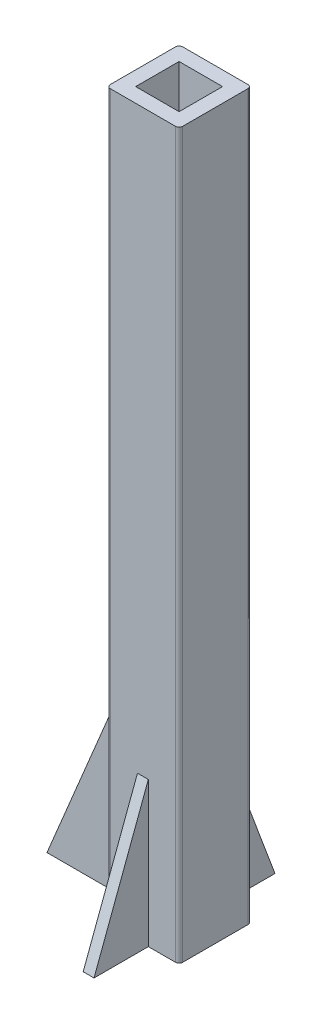
ISO-10303-21;
HEADER;
FILE_DESCRIPTION(('STEP AP214'),'2;1');
FILE_NAME('part.step','',(''),(''),'','','');
FILE_SCHEMA(('AUTOMOTIVE_DESIGN { 1 0 10303 214 1 1 1 1 }'));
ENDSEC;
DATA;
#1=APPLICATION_CONTEXT('core data for automotive mechanical design processes');
#2=APPLICATION_PROTOCOL_DEFINITION('international standard','automotive_design',2000,#1);
#3=PRODUCT_CONTEXT('',#1,'mechanical');
#4=PRODUCT('Part','Part','',(#3));
#5=PRODUCT_RELATED_PRODUCT_CATEGORY('part','',(#4));
#6=PRODUCT_DEFINITION_FORMATION('','',#4);
#7=PRODUCT_DEFINITION_CONTEXT('part definition',#1,'design');
#8=PRODUCT_DEFINITION('design','',#6,#7);
#9=PRODUCT_DEFINITION_SHAPE('','',#8);
#10=(LENGTH_UNIT() NAMED_UNIT(*) SI_UNIT(.MILLI.,.METRE.));
#11=(NAMED_UNIT(*) PLANE_ANGLE_UNIT() SI_UNIT($,.RADIAN.));
#12=(NAMED_UNIT(*) SI_UNIT($,.STERADIAN.) SOLID_ANGLE_UNIT());
#13=UNCERTAINTY_MEASURE_WITH_UNIT(LENGTH_MEASURE(1.E-05),#10,'distance_accuracy_value','');
#14=(GEOMETRIC_REPRESENTATION_CONTEXT(3) GLOBAL_UNCERTAINTY_ASSIGNED_CONTEXT((#13)) GLOBAL_UNIT_ASSIGNED_CONTEXT((#10,
#11,#12)) REPRESENTATION_CONTEXT('',''));
#15=CARTESIAN_POINT('',(0.,0.,0.));
#16=DIRECTION('',(0.,0.,1.));
#17=DIRECTION('',(1.,0.,0.));
#18=AXIS2_PLACEMENT_3D('',#15,#16,#17);
#19=CARTESIAN_POINT('',(-120.263863997574,1779.30525325612,115.));
#20=DIRECTION('',(1.,0.,0.));
#21=DIRECTION('',(0.,0.,-1.));
#22=AXIS2_PLACEMENT_3D('',#19,#20,#21);
#23=PLANE('',#22);
#24=DIRECTION('',(0.,-1.,0.));
#25=VECTOR('',#24,1.);
#26=CARTESIAN_POINT('',(-120.263863997574,-320.694746743877,-42.5));
#27=LINE('',#26,#25);
#28=CARTESIAN_POINT('',(-120.263863997574,-320.694746743877,-42.5));
#29=VERTEX_POINT('',#28);
#30=CARTESIAN_POINT('',(-120.263863997574,-1220.69474674388,-42.5));
#31=VERTEX_POINT('',#30);
#32=EDGE_CURVE('E192',#29,#31,#27,.T.);
#33=ORIENTED_EDGE('',*,*,#32,.F.);
#34=DIRECTION('',(0.,0.,1.));
#35=VECTOR('',#34,1.);
#36=CARTESIAN_POINT('',(-120.263863997574,-320.694746743877,-42.5));
#37=LINE('',#36,#35);
#38=CARTESIAN_POINT('',(-120.263863997574,-320.694746743877,2.49999999999998));
#39=VERTEX_POINT('',#38);
#40=EDGE_CURVE('E189',#29,#39,#37,.T.);
#41=ORIENTED_EDGE('',*,*,#40,.T.);
#42=DIRECTION('',(0.,-1.,0.));
#43=VECTOR('',#42,1.);
#44=CARTESIAN_POINT('',(-120.263863997574,-320.694746743877,2.49999999999998));
#45=LINE('',#44,#43);
#46=CARTESIAN_POINT('',(-120.263863997574,-1220.69474674388,2.49999999999998));
#47=VERTEX_POINT('',#46);
#48=EDGE_CURVE('E200',#39,#47,#45,.T.);
#49=ORIENTED_EDGE('',*,*,#48,.T.);
#50=DIRECTION('',(0.,0.,1.));
#51=VECTOR('',#50,1.);
#52=CARTESIAN_POINT('',(-120.263863997574,-1220.69474674388,115.));
#53=LINE('',#52,#51);
#54=CARTESIAN_POINT('',(-120.263863997574,-1220.69474674388,115.));
#55=VERTEX_POINT('',#54);
#56=EDGE_CURVE('E314',#47,#55,#53,.T.);
#57=ORIENTED_EDGE('',*,*,#56,.T.);
#58=DIRECTION('',(0.,-1.,0.));
#59=VECTOR('',#58,1.);
#60=CARTESIAN_POINT('',(-120.263863997574,1779.30525325612,115.));
#61=LINE('',#60,#59);
#62=CARTESIAN_POINT('',(-120.263863997574,1779.30525325612,115.));
#63=VERTEX_POINT('',#62);
#64=EDGE_CURVE('E297',#63,#55,#61,.T.);
#65=ORIENTED_EDGE('',*,*,#64,.F.);
#66=DIRECTION('',(0.,0.,1.));
#67=VECTOR('',#66,1.);
#68=CARTESIAN_POINT('',(-120.263863997574,1779.30525325612,115.));
#69=LINE('',#68,#67);
#70=CARTESIAN_POINT('',(-120.263863997574,1779.30525325612,-155.));
#71=VERTEX_POINT('',#70);
#72=EDGE_CURVE('E295',#71,#63,#69,.T.);
#73=ORIENTED_EDGE('',*,*,#72,.F.);
#74=DIRECTION('',(0.,-1.,0.));
#75=VECTOR('',#74,1.);
#76=CARTESIAN_POINT('',(-120.263863997574,1779.30525325612,-155.));
#77=LINE('',#76,#75);
#78=CARTESIAN_POINT('',(-120.263863997574,-1220.69474674388,-155.));
#79=VERTEX_POINT('',#78);
#80=EDGE_CURVE('E318',#71,#79,#77,.T.);
#81=ORIENTED_EDGE('',*,*,#80,.T.);
#82=EDGE_CURVE('E283',#79,#31,#53,.T.);
#83=ORIENTED_EDGE('',*,*,#82,.T.);
#84=EDGE_LOOP('',(#33,#41,#49,#57,#65,#73,#81,#83));
#85=FACE_BOUND('',#84,.T.);
#86=ADVANCED_FACE('F39',(#85),#23,.F.);
#87=CARTESIAN_POINT('',(-105.263863997574,1779.30525325612,115.));
#88=DIRECTION('',(0.,-1.,0.));
#89=DIRECTION('',(0.,0.,-1.));
#90=AXIS2_PLACEMENT_3D('',#87,#88,#89);
#91=PLANE('',#90);
#92=CARTESIAN_POINT('',(-105.263863997574,1779.30525325612,115.));
#93=DIRECTION('',(0.,1.,0.));
#94=DIRECTION('',(0.,0.,-1.));
#95=AXIS2_PLACEMENT_3D('',#92,#93,#94);
#96=CIRCLE('',#95,15.);
#97=CARTESIAN_POINT('',(-105.263863997574,1779.30525325612,130.));
#98=VERTEX_POINT('',#97);
#99=EDGE_CURVE('E279',#63,#98,#96,.T.);
#100=ORIENTED_EDGE('',*,*,#99,.T.);
#101=DIRECTION('',(1.,0.,0.));
#102=VECTOR('',#101,1.);
#103=CARTESIAN_POINT('',(-105.263863997574,1779.30525325612,130.));
#104=LINE('',#103,#102);
#105=CARTESIAN_POINT('',(164.736136002426,1779.30525325612,130.));
#106=VERTEX_POINT('',#105);
#107=EDGE_CURVE('E282',#98,#106,#104,.T.);
#108=ORIENTED_EDGE('',*,*,#107,.T.);
#109=CARTESIAN_POINT('',(164.736136002426,1779.30525325612,115.));
#110=DIRECTION('',(0.,1.,0.));
#111=DIRECTION('',(0.,0.,1.));
#112=AXIS2_PLACEMENT_3D('',#109,#110,#111);
#113=CIRCLE('',#112,15.);
#114=CARTESIAN_POINT('',(179.736136002426,1779.30525325612,115.));
#115=VERTEX_POINT('',#114);
#116=EDGE_CURVE('E285',#106,#115,#113,.T.);
#117=ORIENTED_EDGE('',*,*,#116,.T.);
#118=DIRECTION('',(0.,0.,-1.));
#119=VECTOR('',#118,1.);
#120=CARTESIAN_POINT('',(179.736136002426,1779.30525325612,115.));
#121=LINE('',#120,#119);
#122=CARTESIAN_POINT('',(179.736136002426,1779.30525325612,-155.));
#123=VERTEX_POINT('',#122);
#124=EDGE_CURVE('E287',#115,#123,#121,.T.);
#125=ORIENTED_EDGE('',*,*,#124,.T.);
#126=CARTESIAN_POINT('',(164.736136002426,1779.30525325612,-155.));
#127=DIRECTION('',(0.,1.,0.));
#128=DIRECTION('',(0.,0.,-1.));
#129=AXIS2_PLACEMENT_3D('',#126,#127,#128);
#130=CIRCLE('',#129,15.);
#131=CARTESIAN_POINT('',(164.736136002426,1779.30525325612,-170.));
#132=VERTEX_POINT('',#131);
#133=EDGE_CURVE('E289',#123,#132,#130,.T.);
#134=ORIENTED_EDGE('',*,*,#133,.T.);
#135=DIRECTION('',(-1.,0.,0.));
#136=VECTOR('',#135,1.);
#137=CARTESIAN_POINT('',(-105.263863997574,1779.30525325612,-170.));
#138=LINE('',#137,#136);
#139=CARTESIAN_POINT('',(-105.263863997574,1779.30525325612,-170.));
#140=VERTEX_POINT('',#139);
#141=EDGE_CURVE('E291',#132,#140,#138,.T.);
#142=ORIENTED_EDGE('',*,*,#141,.T.);
#143=CARTESIAN_POINT('',(-105.263863997574,1779.30525325612,-155.));
#144=DIRECTION('',(0.,1.,0.));
#145=DIRECTION('',(0.,0.,-1.));
#146=AXIS2_PLACEMENT_3D('',#143,#144,#145);
#147=CIRCLE('',#146,15.);
#148=EDGE_CURVE('E293',#140,#71,#147,.T.);
#149=ORIENTED_EDGE('',*,*,#148,.T.);
#150=ORIENTED_EDGE('',*,*,#72,.T.);
#151=EDGE_LOOP('',(#100,#108,#117,#125,#134,#142,#149,#150));
#152=FACE_BOUND('',#151,.T.);
#153=DIRECTION('',(0.,0.,1.));
#154=VECTOR('',#153,1.);
#155=CARTESIAN_POINT('',(-60.2638639975741,1779.30525325612,70.));
#156=LINE('',#155,#154);
#157=CARTESIAN_POINT('',(-60.2638639975741,1779.30525325612,-110.));
#158=VERTEX_POINT('',#157);
#159=CARTESIAN_POINT('',(-60.2638639975741,1779.30525325612,70.));
#160=VERTEX_POINT('',#159);
#161=EDGE_CURVE('E249',#158,#160,#156,.T.);
#162=ORIENTED_EDGE('',*,*,#161,.F.);
#163=DIRECTION('',(-1.,0.,0.));
#164=VECTOR('',#163,1.);
#165=CARTESIAN_POINT('',(-60.2638639975741,1779.30525325612,-110.));
#166=LINE('',#165,#164);
#167=CARTESIAN_POINT('',(119.736136002426,1779.30525325612,-110.));
#168=VERTEX_POINT('',#167);
#169=EDGE_CURVE('E257',#168,#158,#166,.T.);
#170=ORIENTED_EDGE('',*,*,#169,.F.);
#171=DIRECTION('',(0.,0.,-1.));
#172=VECTOR('',#171,1.);
#173=CARTESIAN_POINT('',(119.736136002426,1779.30525325612,70.));
#174=LINE('',#173,#172);
#175=CARTESIAN_POINT('',(119.736136002426,1779.30525325612,70.));
#176=VERTEX_POINT('',#175);
#177=EDGE_CURVE('E254',#176,#168,#174,.T.);
#178=ORIENTED_EDGE('',*,*,#177,.F.);
#179=DIRECTION('',(1.,0.,0.));
#180=VECTOR('',#179,1.);
#181=CARTESIAN_POINT('',(-60.2638639975741,1779.30525325612,70.));
#182=LINE('',#181,#180);
#183=EDGE_CURVE('E251',#160,#176,#182,.T.);
#184=ORIENTED_EDGE('',*,*,#183,.F.);
#185=EDGE_LOOP('',(#162,#170,#178,#184));
#186=FACE_BOUND('',#185,.T.);
#187=ADVANCED_FACE('F355',(#152,#186),#91,.F.);
#188=CARTESIAN_POINT('',(-105.263863997574,-1220.69474674388,115.));
#189=DIRECTION('',(0.,-1.,0.));
#190=DIRECTION('',(0.,0.,-1.));
#191=AXIS2_PLACEMENT_3D('',#188,#189,#190);
#192=PLANE('',#191);
#193=DIRECTION('',(1.,0.,0.));
#194=VECTOR('',#193,1.);
#195=CARTESIAN_POINT('',(-60.2638639975741,-1220.69474674388,70.));
#196=LINE('',#195,#194);
#197=CARTESIAN_POINT('',(-60.2638639975741,-1220.69474674388,70.));
#198=VERTEX_POINT('',#197);
#199=CARTESIAN_POINT('',(119.736136002426,-1220.69474674388,70.));
#200=VERTEX_POINT('',#199);
#201=EDGE_CURVE('E262',#198,#200,#196,.T.);
#202=ORIENTED_EDGE('',*,*,#201,.T.);
#203=DIRECTION('',(0.,0.,-1.));
#204=VECTOR('',#203,1.);
#205=CARTESIAN_POINT('',(119.736136002426,-1220.69474674388,70.));
#206=LINE('',#205,#204);
#207=CARTESIAN_POINT('',(119.736136002426,-1220.69474674388,-110.));
#208=VERTEX_POINT('',#207);
#209=EDGE_CURVE('E264',#200,#208,#206,.T.);
#210=ORIENTED_EDGE('',*,*,#209,.T.);
#211=DIRECTION('',(-1.,0.,0.));
#212=VECTOR('',#211,1.);
#213=CARTESIAN_POINT('',(-60.2638639975741,-1220.69474674388,-110.));
#214=LINE('',#213,#212);
#215=CARTESIAN_POINT('',(-60.2638639975741,-1220.69474674388,-110.));
#216=VERTEX_POINT('',#215);
#217=EDGE_CURVE('E252',#208,#216,#214,.T.);
#218=ORIENTED_EDGE('',*,*,#217,.T.);
#219=DIRECTION('',(0.,0.,1.));
#220=VECTOR('',#219,1.);
#221=CARTESIAN_POINT('',(-60.2638639975741,-1220.69474674388,70.));
#222=LINE('',#221,#220);
#223=EDGE_CURVE('E248',#216,#198,#222,.T.);
#224=ORIENTED_EDGE('',*,*,#223,.T.);
#225=EDGE_LOOP('',(#202,#210,#218,#224));
#226=FACE_BOUND('',#225,.T.);
#227=DIRECTION('',(0.,0.,1.));
#228=VECTOR('',#227,1.);
#229=CARTESIAN_POINT('',(7.23613600242592,-1220.69474674388,-16.3831962191717));
#230=LINE('',#229,#228);
#231=CARTESIAN_POINT('',(7.23613600242592,-1220.69474674388,130.));
#232=VERTEX_POINT('',#231);
#233=CARTESIAN_POINT('',(7.23613600242592,-1220.69474674388,355.));
#234=VERTEX_POINT('',#233);
#235=EDGE_CURVE('E229',#232,#234,#230,.T.);
#236=ORIENTED_EDGE('',*,*,#235,.F.);
#237=DIRECTION('',(1.,0.,0.));
#238=VECTOR('',#237,1.);
#239=CARTESIAN_POINT('',(-105.263863997574,-1220.69474674388,130.));
#240=LINE('',#239,#238);
#241=CARTESIAN_POINT('',(-105.263863997574,-1220.69474674388,130.));
#242=VERTEX_POINT('',#241);
#243=EDGE_CURVE('E301',#242,#232,#240,.T.);
#244=ORIENTED_EDGE('',*,*,#243,.F.);
#245=CARTESIAN_POINT('',(-105.263863997574,-1220.69474674388,115.));
#246=DIRECTION('',(0.,1.,0.));
#247=DIRECTION('',(0.,0.,-1.));
#248=AXIS2_PLACEMENT_3D('',#245,#246,#247);
#249=CIRCLE('',#248,15.);
#250=EDGE_CURVE('E278',#55,#242,#249,.T.);
#251=ORIENTED_EDGE('',*,*,#250,.F.);
#252=ORIENTED_EDGE('',*,*,#56,.F.);
#253=DIRECTION('',(-1.,0.,0.));
#254=VECTOR('',#253,1.);
#255=CARTESIAN_POINT('',(-120.263863997574,-1220.69474674388,2.49999999999998));
#256=LINE('',#255,#254);
#257=CARTESIAN_POINT('',(-495.263863997574,-1220.69474674388,2.49999999999998));
#258=VERTEX_POINT('',#257);
#259=EDGE_CURVE('E54',#47,#258,#256,.T.);
#260=ORIENTED_EDGE('',*,*,#259,.T.);
#261=DIRECTION('',(0.,0.,1.));
#262=VECTOR('',#261,1.);
#263=CARTESIAN_POINT('',(-495.263863997574,-1220.69474674388,-42.5));
#264=LINE('',#263,#262);
#265=CARTESIAN_POINT('',(-495.263863997574,-1220.69474674388,-42.5));
#266=VERTEX_POINT('',#265);
#267=EDGE_CURVE('E187',#266,#258,#264,.T.);
#268=ORIENTED_EDGE('',*,*,#267,.F.);
#269=DIRECTION('',(-1.,0.,0.));
#270=VECTOR('',#269,1.);
#271=CARTESIAN_POINT('',(-120.263863997574,-1220.69474674388,-42.5));
#272=LINE('',#271,#270);
#273=EDGE_CURVE('E193',#31,#266,#272,.T.);
#274=ORIENTED_EDGE('',*,*,#273,.F.);
#275=ORIENTED_EDGE('',*,*,#82,.F.);
#276=CARTESIAN_POINT('',(-105.263863997574,-1220.69474674388,-155.));
#277=DIRECTION('',(0.,1.,0.));
#278=DIRECTION('',(0.,0.,-1.));
#279=AXIS2_PLACEMENT_3D('',#276,#277,#278);
#280=CIRCLE('',#279,15.);
#281=CARTESIAN_POINT('',(-105.263863997574,-1220.69474674388,-170.));
#282=VERTEX_POINT('',#281);
#283=EDGE_CURVE('E312',#282,#79,#280,.T.);
#284=ORIENTED_EDGE('',*,*,#283,.F.);
#285=DIRECTION('',(-1.,0.,0.));
#286=VECTOR('',#285,1.);
#287=CARTESIAN_POINT('',(-105.263863997574,-1220.69474674388,-170.));
#288=LINE('',#287,#286);
#289=CARTESIAN_POINT('',(7.23613600242592,-1220.69474674388,-170.));
#290=VERTEX_POINT('',#289);
#291=EDGE_CURVE('E309',#290,#282,#288,.T.);
#292=ORIENTED_EDGE('',*,*,#291,.F.);
#293=DIRECTION('',(0.,0.,1.));
#294=VECTOR('',#293,1.);
#295=CARTESIAN_POINT('',(7.23613600242592,-1220.69474674388,85.4213670513897));
#296=LINE('',#295,#294);
#297=CARTESIAN_POINT('',(7.23613600242592,-1220.69474674388,-395.));
#298=VERTEX_POINT('',#297);
#299=EDGE_CURVE('E216',#290,#298,#296,.F.);
#300=ORIENTED_EDGE('',*,*,#299,.T.);
#301=DIRECTION('',(-1.,0.,0.));
#302=VECTOR('',#301,1.);
#303=CARTESIAN_POINT('',(29.7361360024259,-1220.69474674388,-395.));
#304=LINE('',#303,#302);
#305=CARTESIAN_POINT('',(52.2361360024259,-1220.69474674388,-395.));
#306=VERTEX_POINT('',#305);
#307=EDGE_CURVE('E215',#306,#298,#304,.T.);
#308=ORIENTED_EDGE('',*,*,#307,.F.);
#309=DIRECTION('',(0.,0.,1.));
#310=VECTOR('',#309,1.);
#311=CARTESIAN_POINT('',(52.2361360024259,-1220.69474674388,85.4213670513897));
#312=LINE('',#311,#310);
#313=CARTESIAN_POINT('',(52.2361360024259,-1220.69474674388,-170.));
#314=VERTEX_POINT('',#313);
#315=EDGE_CURVE('E205',#314,#306,#312,.F.);
#316=ORIENTED_EDGE('',*,*,#315,.F.);
#317=CARTESIAN_POINT('',(164.736136002426,-1220.69474674388,-170.));
#318=VERTEX_POINT('',#317);
#319=EDGE_CURVE('E310',#318,#314,#288,.T.);
#320=ORIENTED_EDGE('',*,*,#319,.F.);
#321=CARTESIAN_POINT('',(164.736136002426,-1220.69474674388,-155.));
#322=DIRECTION('',(0.,1.,0.));
#323=DIRECTION('',(0.,0.,-1.));
#324=AXIS2_PLACEMENT_3D('',#321,#322,#323);
#325=CIRCLE('',#324,15.);
#326=CARTESIAN_POINT('',(179.736136002426,-1220.69474674388,-155.));
#327=VERTEX_POINT('',#326);
#328=EDGE_CURVE('E307',#327,#318,#325,.T.);
#329=ORIENTED_EDGE('',*,*,#328,.F.);
#330=DIRECTION('',(0.,0.,-1.));
#331=VECTOR('',#330,1.);
#332=CARTESIAN_POINT('',(179.736136002426,-1220.69474674388,115.));
#333=LINE('',#332,#331);
#334=CARTESIAN_POINT('',(179.736136002426,-1220.69474674388,115.));
#335=VERTEX_POINT('',#334);
#336=EDGE_CURVE('E305',#335,#327,#333,.T.);
#337=ORIENTED_EDGE('',*,*,#336,.F.);
#338=CARTESIAN_POINT('',(164.736136002426,-1220.69474674388,115.));
#339=DIRECTION('',(0.,1.,0.));
#340=DIRECTION('',(0.,0.,1.));
#341=AXIS2_PLACEMENT_3D('',#338,#339,#340);
#342=CIRCLE('',#341,15.);
#343=CARTESIAN_POINT('',(164.736136002426,-1220.69474674388,130.));
#344=VERTEX_POINT('',#343);
#345=EDGE_CURVE('E303',#344,#335,#342,.T.);
#346=ORIENTED_EDGE('',*,*,#345,.F.);
#347=CARTESIAN_POINT('',(52.2361360024259,-1220.69474674388,130.));
#348=VERTEX_POINT('',#347);
#349=EDGE_CURVE('E300',#348,#344,#240,.T.);
#350=ORIENTED_EDGE('',*,*,#349,.F.);
#351=DIRECTION('',(0.,0.,1.));
#352=VECTOR('',#351,1.);
#353=CARTESIAN_POINT('',(52.2361360024259,-1220.69474674388,-16.3831962191717));
#354=LINE('',#353,#352);
#355=CARTESIAN_POINT('',(52.2361360024259,-1220.69474674388,355.));
#356=VERTEX_POINT('',#355);
#357=EDGE_CURVE('E228',#348,#356,#354,.T.);
#358=ORIENTED_EDGE('',*,*,#357,.T.);
#359=DIRECTION('',(-1.,0.,0.));
#360=VECTOR('',#359,1.);
#361=CARTESIAN_POINT('',(29.7361360024259,-1220.69474674388,355.));
#362=LINE('',#361,#360);
#363=EDGE_CURVE('E235',#356,#234,#362,.T.);
#364=ORIENTED_EDGE('',*,*,#363,.T.);
#365=EDGE_LOOP('',(#236,#244,#251,#252,#260,#268,#274,#275,#284,#292,#300,#308,#316,#320,#329,
#337,#346,#350,#358,#364));
#366=FACE_BOUND('',#365,.T.);
#367=ADVANCED_FACE('F203',(#226,#366),#192,.T.);
#368=CARTESIAN_POINT('',(-105.263863997574,1779.30525325612,115.));
#369=DIRECTION('',(0.,-1.,0.));
#370=DIRECTION('',(0.,0.,-1.));
#371=AXIS2_PLACEMENT_3D('',#368,#369,#370);
#372=CYLINDRICAL_SURFACE('',#371,15.);
#373=ORIENTED_EDGE('',*,*,#250,.T.);
#374=DIRECTION('',(0.,-1.,0.));
#375=VECTOR('',#374,1.);
#376=CARTESIAN_POINT('',(-105.263863997574,1779.30525325612,130.));
#377=LINE('',#376,#375);
#378=EDGE_CURVE('E11',#98,#242,#377,.T.);
#379=ORIENTED_EDGE('',*,*,#378,.F.);
#380=ORIENTED_EDGE('',*,*,#99,.F.);
#381=ORIENTED_EDGE('',*,*,#64,.T.);
#382=EDGE_LOOP('',(#373,#379,#380,#381));
#383=FACE_BOUND('',#382,.T.);
#384=ADVANCED_FACE('F41',(#383),#372,.T.);
#385=CARTESIAN_POINT('',(-105.263863997574,1779.30525325612,130.));
#386=DIRECTION('',(0.,0.,-1.));
#387=DIRECTION('',(-1.,0.,0.));
#388=AXIS2_PLACEMENT_3D('',#385,#386,#387);
#389=PLANE('',#388);
#390=DIRECTION('',(0.,1.,0.));
#391=VECTOR('',#390,1.);
#392=CARTESIAN_POINT('',(7.23613600242592,1779.30525325612,130.));
#393=LINE('',#392,#391);
#394=CARTESIAN_POINT('',(7.2361360024259,-620.694746743877,130.));
#395=VERTEX_POINT('',#394);
#396=EDGE_CURVE('E244',#232,#395,#393,.T.);
#397=ORIENTED_EDGE('',*,*,#396,.T.);
#398=DIRECTION('',(1.,0.,0.));
#399=VECTOR('',#398,1.);
#400=CARTESIAN_POINT('',(-105.263863997574,-620.694746743877,130.));
#401=LINE('',#400,#399);
#402=CARTESIAN_POINT('',(52.2361360024259,-620.694746743877,130.));
#403=VERTEX_POINT('',#402);
#404=EDGE_CURVE('E246',#395,#403,#401,.T.);
#405=ORIENTED_EDGE('',*,*,#404,.T.);
#406=DIRECTION('',(0.,1.,0.));
#407=VECTOR('',#406,1.);
#408=CARTESIAN_POINT('',(52.2361360024259,1779.30525325612,130.));
#409=LINE('',#408,#407);
#410=EDGE_CURVE('E241',#348,#403,#409,.T.);
#411=ORIENTED_EDGE('',*,*,#410,.F.);
#412=ORIENTED_EDGE('',*,*,#349,.T.);
#413=DIRECTION('',(0.,-1.,0.));
#414=VECTOR('',#413,1.);
#415=CARTESIAN_POINT('',(164.736136002426,1779.30525325612,130.));
#416=LINE('',#415,#414);
#417=EDGE_CURVE('E47',#106,#344,#416,.T.);
#418=ORIENTED_EDGE('',*,*,#417,.F.);
#419=ORIENTED_EDGE('',*,*,#107,.F.);
#420=ORIENTED_EDGE('',*,*,#378,.T.);
#421=ORIENTED_EDGE('',*,*,#243,.T.);
#422=EDGE_LOOP('',(#397,#405,#411,#412,#418,#419,#420,#421));
#423=FACE_BOUND('',#422,.T.);
#424=ADVANCED_FACE('F360',(#423),#389,.F.);
#425=CARTESIAN_POINT('',(164.736136002426,1779.30525325612,115.));
#426=DIRECTION('',(0.,-1.,0.));
#427=DIRECTION('',(0.,0.,-1.));
#428=AXIS2_PLACEMENT_3D('',#425,#426,#427);
#429=CYLINDRICAL_SURFACE('',#428,15.);
#430=ORIENTED_EDGE('',*,*,#345,.T.);
#431=DIRECTION('',(0.,-1.,0.));
#432=VECTOR('',#431,1.);
#433=CARTESIAN_POINT('',(179.736136002426,1779.30525325612,115.));
#434=LINE('',#433,#432);
#435=EDGE_CURVE('E330',#115,#335,#434,.T.);
#436=ORIENTED_EDGE('',*,*,#435,.F.);
#437=ORIENTED_EDGE('',*,*,#116,.F.);
#438=ORIENTED_EDGE('',*,*,#417,.T.);
#439=EDGE_LOOP('',(#430,#436,#437,#438));
#440=FACE_BOUND('',#439,.T.);
#441=ADVANCED_FACE('F337',(#440),#429,.T.);
#442=CARTESIAN_POINT('',(179.736136002426,1779.30525325612,115.));
#443=DIRECTION('',(-1.,0.,0.));
#444=DIRECTION('',(0.,0.,1.));
#445=AXIS2_PLACEMENT_3D('',#442,#443,#444);
#446=PLANE('',#445);
#447=ORIENTED_EDGE('',*,*,#336,.T.);
#448=DIRECTION('',(0.,-1.,0.));
#449=VECTOR('',#448,1.);
#450=CARTESIAN_POINT('',(179.736136002426,1779.30525325612,-155.));
#451=LINE('',#450,#449);
#452=EDGE_CURVE('E327',#123,#327,#451,.T.);
#453=ORIENTED_EDGE('',*,*,#452,.F.);
#454=ORIENTED_EDGE('',*,*,#124,.F.);
#455=ORIENTED_EDGE('',*,*,#435,.T.);
#456=EDGE_LOOP('',(#447,#453,#454,#455));
#457=FACE_BOUND('',#456,.T.);
#458=ADVANCED_FACE('F347',(#457),#446,.F.);
#459=CARTESIAN_POINT('',(164.736136002426,1779.30525325612,-155.));
#460=DIRECTION('',(0.,-1.,0.));
#461=DIRECTION('',(0.,0.,-1.));
#462=AXIS2_PLACEMENT_3D('',#459,#460,#461);
#463=CYLINDRICAL_SURFACE('',#462,15.);
#464=ORIENTED_EDGE('',*,*,#328,.T.);
#465=DIRECTION('',(0.,-1.,0.));
#466=VECTOR('',#465,1.);
#467=CARTESIAN_POINT('',(164.736136002426,1779.30525325612,-170.));
#468=LINE('',#467,#466);
#469=EDGE_CURVE('E324',#132,#318,#468,.T.);
#470=ORIENTED_EDGE('',*,*,#469,.F.);
#471=ORIENTED_EDGE('',*,*,#133,.F.);
#472=ORIENTED_EDGE('',*,*,#452,.T.);
#473=EDGE_LOOP('',(#464,#470,#471,#472));
#474=FACE_BOUND('',#473,.T.);
#475=ADVANCED_FACE('F351',(#474),#463,.T.);
#476=CARTESIAN_POINT('',(-105.263863997574,1779.30525325612,-170.));
#477=DIRECTION('',(0.,0.,1.));
#478=DIRECTION('',(1.,0.,0.));
#479=AXIS2_PLACEMENT_3D('',#476,#477,#478);
#480=PLANE('',#479);
#481=DIRECTION('',(1.,0.,0.));
#482=VECTOR('',#481,1.);
#483=CARTESIAN_POINT('',(-105.263863997574,-620.694746743877,-170.));
#484=LINE('',#483,#482);
#485=CARTESIAN_POINT('',(52.2361360024259,-620.694746743877,-170.));
#486=VERTEX_POINT('',#485);
#487=CARTESIAN_POINT('',(7.2361360024259,-620.694746743877,-170.));
#488=VERTEX_POINT('',#487);
#489=EDGE_CURVE('E62',#486,#488,#484,.F.);
#490=ORIENTED_EDGE('',*,*,#489,.T.);
#491=DIRECTION('',(0.,-1.,0.));
#492=VECTOR('',#491,1.);
#493=CARTESIAN_POINT('',(7.23613600242592,1779.30525325612,-170.));
#494=LINE('',#493,#492);
#495=EDGE_CURVE('E225',#488,#290,#494,.T.);
#496=ORIENTED_EDGE('',*,*,#495,.T.);
#497=ORIENTED_EDGE('',*,*,#291,.T.);
#498=DIRECTION('',(0.,-1.,0.));
#499=VECTOR('',#498,1.);
#500=CARTESIAN_POINT('',(-105.263863997574,1779.30525325612,-170.));
#501=LINE('',#500,#499);
#502=EDGE_CURVE('E321',#140,#282,#501,.T.);
#503=ORIENTED_EDGE('',*,*,#502,.F.);
#504=ORIENTED_EDGE('',*,*,#141,.F.);
#505=ORIENTED_EDGE('',*,*,#469,.T.);
#506=ORIENTED_EDGE('',*,*,#319,.T.);
#507=DIRECTION('',(0.,-1.,0.));
#508=VECTOR('',#507,1.);
#509=CARTESIAN_POINT('',(52.2361360024259,1779.30525325612,-170.));
#510=LINE('',#509,#508);
#511=EDGE_CURVE('E222',#486,#314,#510,.T.);
#512=ORIENTED_EDGE('',*,*,#511,.F.);
#513=EDGE_LOOP('',(#490,#496,#497,#503,#504,#505,#506,#512));
#514=FACE_BOUND('',#513,.T.);
#515=ADVANCED_FACE('F400',(#514),#480,.F.);
#516=CARTESIAN_POINT('',(-105.263863997574,1779.30525325612,-155.));
#517=DIRECTION('',(0.,-1.,0.));
#518=DIRECTION('',(0.,0.,-1.));
#519=AXIS2_PLACEMENT_3D('',#516,#517,#518);
#520=CYLINDRICAL_SURFACE('',#519,15.);
#521=ORIENTED_EDGE('',*,*,#283,.T.);
#522=ORIENTED_EDGE('',*,*,#80,.F.);
#523=ORIENTED_EDGE('',*,*,#148,.F.);
#524=ORIENTED_EDGE('',*,*,#502,.T.);
#525=EDGE_LOOP('',(#521,#522,#523,#524));
#526=FACE_BOUND('',#525,.T.);
#527=ADVANCED_FACE('F396',(#526),#520,.T.);
#528=CARTESIAN_POINT('',(-60.2638639975741,1779.30525325612,70.));
#529=DIRECTION('',(1.,0.,0.));
#530=DIRECTION('',(0.,0.,-1.));
#531=AXIS2_PLACEMENT_3D('',#528,#529,#530);
#532=PLANE('',#531);
#533=ORIENTED_EDGE('',*,*,#223,.F.);
#534=DIRECTION('',(0.,-1.,0.));
#535=VECTOR('',#534,1.);
#536=CARTESIAN_POINT('',(-60.2638639975741,1779.30525325612,-110.));
#537=LINE('',#536,#535);
#538=EDGE_CURVE('E259',#158,#216,#537,.T.);
#539=ORIENTED_EDGE('',*,*,#538,.F.);
#540=ORIENTED_EDGE('',*,*,#161,.T.);
#541=DIRECTION('',(0.,-1.,0.));
#542=VECTOR('',#541,1.);
#543=CARTESIAN_POINT('',(-60.2638639975741,1779.30525325612,70.));
#544=LINE('',#543,#542);
#545=EDGE_CURVE('E275',#160,#198,#544,.T.);
#546=ORIENTED_EDGE('',*,*,#545,.T.);
#547=EDGE_LOOP('',(#533,#539,#540,#546));
#548=FACE_BOUND('',#547,.T.);
#549=ADVANCED_FACE('F399',(#548),#532,.T.);
#550=CARTESIAN_POINT('',(-60.2638639975741,1779.30525325612,70.));
#551=DIRECTION('',(0.,0.,-1.));
#552=DIRECTION('',(-1.,0.,0.));
#553=AXIS2_PLACEMENT_3D('',#550,#551,#552);
#554=PLANE('',#553);
#555=DIRECTION('',(0.,-1.,0.));
#556=VECTOR('',#555,1.);
#557=CARTESIAN_POINT('',(119.736136002426,1779.30525325612,70.));
#558=LINE('',#557,#556);
#559=EDGE_CURVE('E272',#176,#200,#558,.T.);
#560=ORIENTED_EDGE('',*,*,#559,.T.);
#561=ORIENTED_EDGE('',*,*,#201,.F.);
#562=ORIENTED_EDGE('',*,*,#545,.F.);
#563=ORIENTED_EDGE('',*,*,#183,.T.);
#564=EDGE_LOOP('',(#560,#561,#562,#563));
#565=FACE_BOUND('',#564,.T.);
#566=ADVANCED_FACE('F424',(#565),#554,.T.);
#567=CARTESIAN_POINT('',(119.736136002426,1779.30525325612,70.));
#568=DIRECTION('',(-1.,0.,0.));
#569=DIRECTION('',(0.,0.,1.));
#570=AXIS2_PLACEMENT_3D('',#567,#568,#569);
#571=PLANE('',#570);
#572=ORIENTED_EDGE('',*,*,#209,.F.);
#573=ORIENTED_EDGE('',*,*,#559,.F.);
#574=ORIENTED_EDGE('',*,*,#177,.T.);
#575=DIRECTION('',(0.,-1.,0.));
#576=VECTOR('',#575,1.);
#577=CARTESIAN_POINT('',(119.736136002426,1779.30525325612,-110.));
#578=LINE('',#577,#576);
#579=EDGE_CURVE('E270',#168,#208,#578,.T.);
#580=ORIENTED_EDGE('',*,*,#579,.T.);
#581=EDGE_LOOP('',(#572,#573,#574,#580));
#582=FACE_BOUND('',#581,.T.);
#583=ADVANCED_FACE('F428',(#582),#571,.T.);
#584=CARTESIAN_POINT('',(-60.2638639975741,1779.30525325612,-110.));
#585=DIRECTION('',(0.,0.,1.));
#586=DIRECTION('',(1.,0.,0.));
#587=AXIS2_PLACEMENT_3D('',#584,#585,#586);
#588=PLANE('',#587);
#589=ORIENTED_EDGE('',*,*,#538,.T.);
#590=ORIENTED_EDGE('',*,*,#217,.F.);
#591=ORIENTED_EDGE('',*,*,#579,.F.);
#592=ORIENTED_EDGE('',*,*,#169,.T.);
#593=EDGE_LOOP('',(#589,#590,#591,#592));
#594=FACE_BOUND('',#593,.T.);
#595=ADVANCED_FACE('F432',(#594),#588,.T.);
#596=CARTESIAN_POINT('',(29.7361360024259,-1220.69474674388,355.));
#597=DIRECTION('',(0.,0.351123441588392,0.936329177569045));
#598=DIRECTION('',(0.,0.936329177569045,-0.351123441588392));
#599=AXIS2_PLACEMENT_3D('',#596,#597,#598);
#600=PLANE('',#599);
#601=ORIENTED_EDGE('',*,*,#404,.F.);
#602=DIRECTION('',(0.,0.936329177569045,-0.351123441588392));
#603=VECTOR('',#602,1.);
#604=CARTESIAN_POINT('',(7.23613600242592,-1220.69474674388,355.));
#605=LINE('',#604,#603);
#606=EDGE_CURVE('E231',#234,#395,#605,.T.);
#607=ORIENTED_EDGE('',*,*,#606,.F.);
#608=ORIENTED_EDGE('',*,*,#363,.F.);
#609=DIRECTION('',(0.,0.936329177569045,-0.351123441588392));
#610=VECTOR('',#609,1.);
#611=CARTESIAN_POINT('',(52.2361360024259,-1220.69474674388,355.));
#612=LINE('',#611,#610);
#613=EDGE_CURVE('E232',#356,#403,#612,.T.);
#614=ORIENTED_EDGE('',*,*,#613,.T.);
#615=EDGE_LOOP('',(#601,#607,#608,#614));
#616=FACE_BOUND('',#615,.T.);
#617=ADVANCED_FACE('F371',(#616),#600,.T.);
#618=CARTESIAN_POINT('',(7.23613600242592,262.771293115194,-16.3831962191717));
#619=DIRECTION('',(-1.,0.,0.));
#620=DIRECTION('',(0.,0.,1.));
#621=AXIS2_PLACEMENT_3D('',#618,#619,#620);
#622=PLANE('',#621);
#623=ORIENTED_EDGE('',*,*,#396,.F.);
#624=ORIENTED_EDGE('',*,*,#235,.T.);
#625=ORIENTED_EDGE('',*,*,#606,.T.);
#626=EDGE_LOOP('',(#623,#624,#625));
#627=FACE_BOUND('',#626,.T.);
#628=ADVANCED_FACE('F368',(#627),#622,.T.);
#629=CARTESIAN_POINT('',(52.2361360024259,262.771293115194,-16.3831962191717));
#630=DIRECTION('',(-1.,0.,0.));
#631=DIRECTION('',(0.,0.,1.));
#632=AXIS2_PLACEMENT_3D('',#629,#630,#631);
#633=PLANE('',#632);
#634=ORIENTED_EDGE('',*,*,#357,.F.);
#635=ORIENTED_EDGE('',*,*,#410,.T.);
#636=ORIENTED_EDGE('',*,*,#613,.F.);
#637=EDGE_LOOP('',(#634,#635,#636));
#638=FACE_BOUND('',#637,.T.);
#639=ADVANCED_FACE('F374',(#638),#633,.F.);
#640=CARTESIAN_POINT('',(29.7361360024259,-1220.69474674388,-395.));
#641=DIRECTION('',(0.,-0.351123441588392,0.936329177569045));
#642=DIRECTION('',(0.,0.936329177569045,0.351123441588392));
#643=AXIS2_PLACEMENT_3D('',#640,#641,#642);
#644=PLANE('',#643);
#645=ORIENTED_EDGE('',*,*,#489,.F.);
#646=DIRECTION('',(0.,0.936329177569045,0.351123441588392));
#647=VECTOR('',#646,1.);
#648=CARTESIAN_POINT('',(52.2361360024259,-1220.69474674388,-395.));
#649=LINE('',#648,#647);
#650=EDGE_CURVE('E207',#306,#486,#649,.T.);
#651=ORIENTED_EDGE('',*,*,#650,.F.);
#652=ORIENTED_EDGE('',*,*,#307,.T.);
#653=DIRECTION('',(0.,0.936329177569045,0.351123441588392));
#654=VECTOR('',#653,1.);
#655=CARTESIAN_POINT('',(7.23613600242592,-1220.69474674388,-395.));
#656=LINE('',#655,#654);
#657=EDGE_CURVE('E212',#298,#488,#656,.T.);
#658=ORIENTED_EDGE('',*,*,#657,.T.);
#659=EDGE_LOOP('',(#645,#651,#652,#658));
#660=FACE_BOUND('',#659,.T.);
#661=ADVANCED_FACE('F376',(#660),#644,.F.);
#662=CARTESIAN_POINT('',(7.23613600242592,256.65362782057,85.4213670513897));
#663=DIRECTION('',(-1.,0.,0.));
#664=DIRECTION('',(0.,0.,1.));
#665=AXIS2_PLACEMENT_3D('',#662,#663,#664);
#666=PLANE('',#665);
#667=ORIENTED_EDGE('',*,*,#495,.F.);
#668=ORIENTED_EDGE('',*,*,#657,.F.);
#669=ORIENTED_EDGE('',*,*,#299,.F.);
#670=EDGE_LOOP('',(#667,#668,#669));
#671=FACE_BOUND('',#670,.T.);
#672=ADVANCED_FACE('F382',(#671),#666,.T.);
#673=CARTESIAN_POINT('',(52.2361360024259,256.65362782057,85.4213670513897));
#674=DIRECTION('',(-1.,0.,0.));
#675=DIRECTION('',(0.,0.,1.));
#676=AXIS2_PLACEMENT_3D('',#673,#674,#675);
#677=PLANE('',#676);
#678=ORIENTED_EDGE('',*,*,#650,.T.);
#679=ORIENTED_EDGE('',*,*,#511,.T.);
#680=ORIENTED_EDGE('',*,*,#315,.T.);
#681=EDGE_LOOP('',(#678,#679,#680));
#682=FACE_BOUND('',#681,.T.);
#683=ADVANCED_FACE('F478',(#682),#677,.F.);
#684=CARTESIAN_POINT('',(-495.263863997574,-1220.69474674388,-42.5));
#685=DIRECTION('',(0.923076923076923,-0.384615384615385,0.));
#686=DIRECTION('',(0.384615384615385,0.923076923076923,0.));
#687=AXIS2_PLACEMENT_3D('',#684,#685,#686);
#688=PLANE('',#687);
#689=DIRECTION('',(0.384615384615385,0.923076923076923,0.));
#690=VECTOR('',#689,1.);
#691=CARTESIAN_POINT('',(-495.263863997574,-1220.69474674388,2.49999999999998));
#692=LINE('',#691,#690);
#693=EDGE_CURVE('E518',#258,#39,#692,.T.);
#694=ORIENTED_EDGE('',*,*,#693,.T.);
#695=ORIENTED_EDGE('',*,*,#40,.F.);
#696=DIRECTION('',(0.384615384615385,0.923076923076923,0.));
#697=VECTOR('',#696,1.);
#698=CARTESIAN_POINT('',(-495.263863997574,-1220.69474674388,-42.5));
#699=LINE('',#698,#697);
#700=EDGE_CURVE('E183',#266,#29,#699,.T.);
#701=ORIENTED_EDGE('',*,*,#700,.F.);
#702=ORIENTED_EDGE('',*,*,#267,.T.);
#703=EDGE_LOOP('',(#694,#695,#701,#702));
#704=FACE_BOUND('',#703,.T.);
#705=ADVANCED_FACE('F185',(#704),#688,.F.);
#706=CARTESIAN_POINT('',(-120.263863997574,-1220.69474674388,-42.5));
#707=DIRECTION('',(0.,0.,1.));
#708=DIRECTION('',(1.,0.,0.));
#709=AXIS2_PLACEMENT_3D('',#706,#707,#708);
#710=PLANE('',#709);
#711=ORIENTED_EDGE('',*,*,#273,.T.);
#712=ORIENTED_EDGE('',*,*,#700,.T.);
#713=ORIENTED_EDGE('',*,*,#32,.T.);
#714=EDGE_LOOP('',(#711,#712,#713));
#715=FACE_BOUND('',#714,.T.);
#716=ADVANCED_FACE('F196',(#715),#710,.F.);
#717=CARTESIAN_POINT('',(-120.263863997574,-1220.69474674388,2.49999999999998));
#718=DIRECTION('',(0.,0.,1.));
#719=DIRECTION('',(1.,0.,0.));
#720=AXIS2_PLACEMENT_3D('',#717,#718,#719);
#721=PLANE('',#720);
#722=ORIENTED_EDGE('',*,*,#259,.F.);
#723=ORIENTED_EDGE('',*,*,#48,.F.);
#724=ORIENTED_EDGE('',*,*,#693,.F.);
#725=EDGE_LOOP('',(#722,#723,#724));
#726=FACE_BOUND('',#725,.T.);
#727=ADVANCED_FACE('F499',(#726),#721,.T.);
#728=CLOSED_SHELL('',(#86,#187,#367,#384,#424,#441,#458,#475,#515,#527,#549,#566,#583,#595,#617,
#628,#639,#661,#672,#683,#705,#716,#727));
#729=MANIFOLD_SOLID_BREP('B2',#728);
#730=ADVANCED_BREP_SHAPE_REPRESENTATION('',(#18,#729),#14);
#731=SHAPE_DEFINITION_REPRESENTATION(#9,#730);
ENDSEC;
END-ISO-10303-21;
